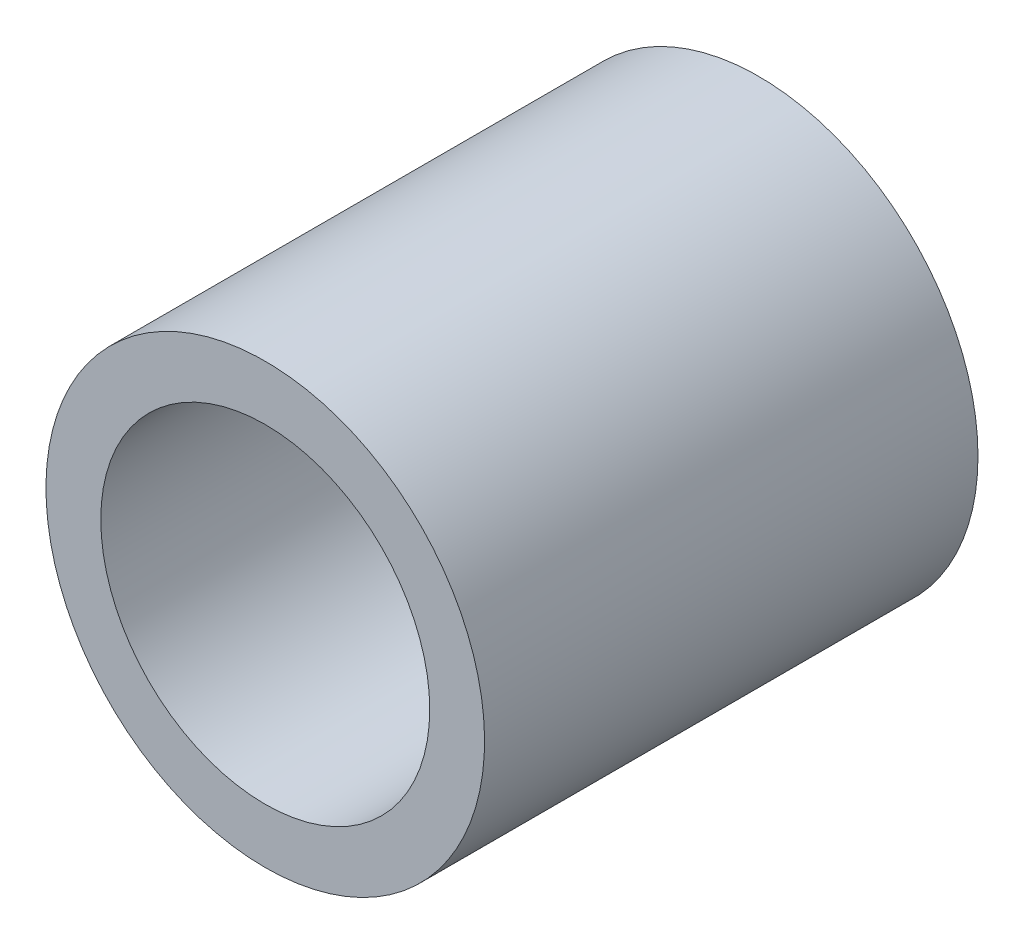
ISO-10303-21;
HEADER;
FILE_DESCRIPTION(('STEP AP214'),'2;1');
FILE_NAME('part.step','',(''),(''),'','','');
FILE_SCHEMA(('AUTOMOTIVE_DESIGN { 1 0 10303 214 1 1 1 1 }'));
ENDSEC;
DATA;
#1=APPLICATION_CONTEXT('core data for automotive mechanical design processes');
#2=APPLICATION_PROTOCOL_DEFINITION('international standard','automotive_design',2000,#1);
#3=PRODUCT_CONTEXT('',#1,'mechanical');
#4=PRODUCT('Part','Part','',(#3));
#5=PRODUCT_RELATED_PRODUCT_CATEGORY('part','',(#4));
#6=PRODUCT_DEFINITION_FORMATION('','',#4);
#7=PRODUCT_DEFINITION_CONTEXT('part definition',#1,'design');
#8=PRODUCT_DEFINITION('design','',#6,#7);
#9=PRODUCT_DEFINITION_SHAPE('','',#8);
#10=(LENGTH_UNIT() NAMED_UNIT(*) SI_UNIT(.MILLI.,.METRE.));
#11=(NAMED_UNIT(*) PLANE_ANGLE_UNIT() SI_UNIT($,.RADIAN.));
#12=(NAMED_UNIT(*) SI_UNIT($,.STERADIAN.) SOLID_ANGLE_UNIT());
#13=UNCERTAINTY_MEASURE_WITH_UNIT(LENGTH_MEASURE(1.E-05),#10,'distance_accuracy_value','');
#14=(GEOMETRIC_REPRESENTATION_CONTEXT(3) GLOBAL_UNCERTAINTY_ASSIGNED_CONTEXT((#13)) GLOBAL_UNIT_ASSIGNED_CONTEXT((#10,
#11,#12)) REPRESENTATION_CONTEXT('',''));
#15=CARTESIAN_POINT('',(0.,0.,0.));
#16=DIRECTION('',(0.,0.,1.));
#17=DIRECTION('',(1.,0.,0.));
#18=AXIS2_PLACEMENT_3D('',#15,#16,#17);
#19=CARTESIAN_POINT('',(0.,0.,64.4960244842766));
#20=DIRECTION('',(0.,0.,-1.));
#21=DIRECTION('',(-1.,0.,0.));
#22=AXIS2_PLACEMENT_3D('',#19,#20,#21);
#23=CYLINDRICAL_SURFACE('',#22,12.7);
#24=CARTESIAN_POINT('',(0.,0.,0.));
#25=DIRECTION('',(0.,0.,1.));
#26=DIRECTION('',(1.,0.,0.));
#27=AXIS2_PLACEMENT_3D('',#24,#25,#26);
#28=CIRCLE('',#27,12.7);
#29=CARTESIAN_POINT('',(12.7,0.,0.));
#30=VERTEX_POINT('',#29);
#31=EDGE_CURVE('E44',#30,#30,#28,.T.);
#32=ORIENTED_EDGE('',*,*,#31,.T.);
#33=EDGE_LOOP('',(#32));
#34=FACE_BOUND('',#33,.T.);
#35=CARTESIAN_POINT('',(0.,0.,28.575));
#36=DIRECTION('',(0.,0.,1.));
#37=DIRECTION('',(0.,-1.,0.));
#38=AXIS2_PLACEMENT_3D('',#35,#36,#37);
#39=CIRCLE('',#38,12.7);
#40=CARTESIAN_POINT('',(0.,-12.7,28.575));
#41=VERTEX_POINT('',#40);
#42=EDGE_CURVE('E10',#41,#41,#39,.T.);
#43=ORIENTED_EDGE('',*,*,#42,.F.);
#44=EDGE_LOOP('',(#43));
#45=FACE_BOUND('',#44,.T.);
#46=ADVANCED_FACE('F37',(#34,#45),#23,.T.);
#47=CARTESIAN_POINT('',(0.,0.,0.));
#48=DIRECTION('',(0.,0.,1.));
#49=DIRECTION('',(1.,0.,0.));
#50=AXIS2_PLACEMENT_3D('',#47,#48,#49);
#51=PLANE('',#50);
#52=CARTESIAN_POINT('',(0.,0.,0.));
#53=DIRECTION('',(0.,0.,1.));
#54=DIRECTION('',(1.,0.,0.));
#55=AXIS2_PLACEMENT_3D('',#52,#53,#54);
#56=CIRCLE('',#55,9.525);
#57=CARTESIAN_POINT('',(9.525,0.,0.));
#58=VERTEX_POINT('',#57);
#59=EDGE_CURVE('E48',#58,#58,#56,.T.);
#60=ORIENTED_EDGE('',*,*,#59,.T.);
#61=EDGE_LOOP('',(#60));
#62=FACE_BOUND('',#61,.T.);
#63=ORIENTED_EDGE('',*,*,#31,.F.);
#64=EDGE_LOOP('',(#63));
#65=FACE_BOUND('',#64,.T.);
#66=ADVANCED_FACE('F61',(#62,#65),#51,.F.);
#67=CARTESIAN_POINT('',(0.,0.,28.575));
#68=DIRECTION('',(0.,0.,1.));
#69=DIRECTION('',(0.989730965497,-0.142942701584851,0.));
#70=AXIS2_PLACEMENT_3D('',#67,#68,#69);
#71=PLANE('',#70);
#72=CARTESIAN_POINT('',(0.,0.,28.575));
#73=DIRECTION('',(0.,0.,1.));
#74=DIRECTION('',(1.,0.,0.));
#75=AXIS2_PLACEMENT_3D('',#72,#73,#74);
#76=CIRCLE('',#75,9.525);
#77=CARTESIAN_POINT('',(9.525,0.,28.575));
#78=VERTEX_POINT('',#77);
#79=EDGE_CURVE('E52',#78,#78,#76,.T.);
#80=ORIENTED_EDGE('',*,*,#79,.F.);
#81=EDGE_LOOP('',(#80));
#82=FACE_BOUND('',#81,.T.);
#83=ORIENTED_EDGE('',*,*,#42,.T.);
#84=EDGE_LOOP('',(#83));
#85=FACE_BOUND('',#84,.T.);
#86=ADVANCED_FACE('F39',(#82,#85),#71,.T.);
#87=CARTESIAN_POINT('',(0.,0.,0.));
#88=DIRECTION('',(0.,0.,1.));
#89=DIRECTION('',(1.,0.,0.));
#90=AXIS2_PLACEMENT_3D('',#87,#88,#89);
#91=CYLINDRICAL_SURFACE('',#90,9.525);
#92=ORIENTED_EDGE('',*,*,#59,.F.);
#93=EDGE_LOOP('',(#92));
#94=FACE_BOUND('',#93,.T.);
#95=ORIENTED_EDGE('',*,*,#79,.T.);
#96=EDGE_LOOP('',(#95));
#97=FACE_BOUND('',#96,.T.);
#98=ADVANCED_FACE('F58',(#94,#97),#91,.F.);
#99=CLOSED_SHELL('',(#46,#66,#86,#98));
#100=MANIFOLD_SOLID_BREP('B2',#99);
#101=ADVANCED_BREP_SHAPE_REPRESENTATION('',(#18,#100),#14);
#102=SHAPE_DEFINITION_REPRESENTATION(#9,#101);
ENDSEC;
END-ISO-10303-21;
